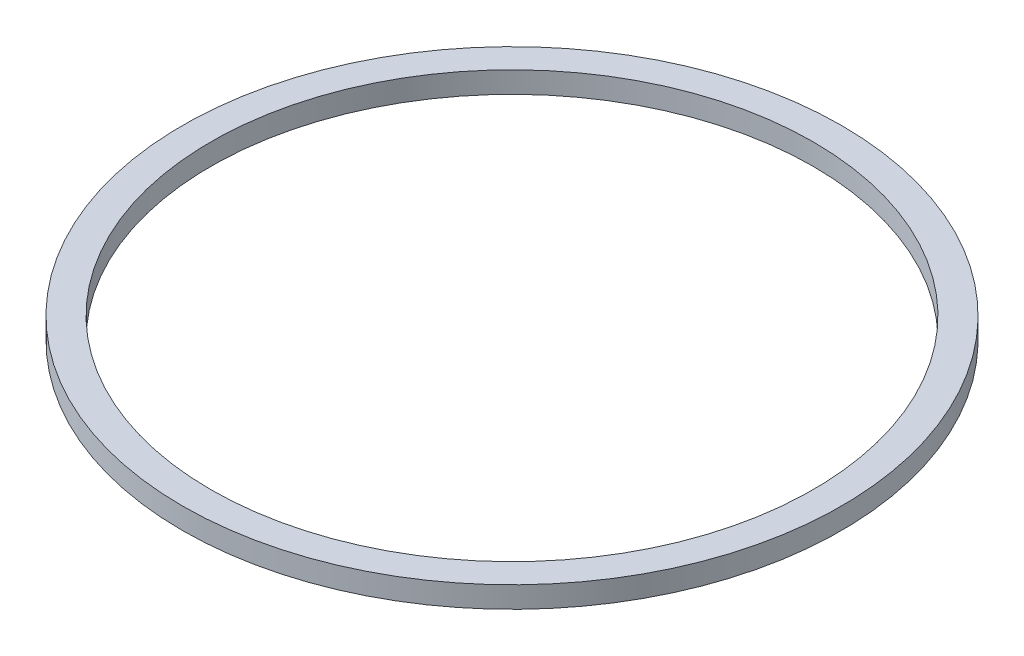
ISO-10303-21;
HEADER;
FILE_DESCRIPTION(('STEP AP214'),'2;1');
FILE_NAME('part.step','',(''),(''),'','','');
FILE_SCHEMA(('AUTOMOTIVE_DESIGN { 1 0 10303 214 1 1 1 1 }'));
ENDSEC;
DATA;
#1=APPLICATION_CONTEXT('core data for automotive mechanical design processes');
#2=APPLICATION_PROTOCOL_DEFINITION('international standard','automotive_design',2000,#1);
#3=PRODUCT_CONTEXT('',#1,'mechanical');
#4=PRODUCT('Part','Part','',(#3));
#5=PRODUCT_RELATED_PRODUCT_CATEGORY('part','',(#4));
#6=PRODUCT_DEFINITION_FORMATION('','',#4);
#7=PRODUCT_DEFINITION_CONTEXT('part definition',#1,'design');
#8=PRODUCT_DEFINITION('design','',#6,#7);
#9=PRODUCT_DEFINITION_SHAPE('','',#8);
#10=(LENGTH_UNIT() NAMED_UNIT(*) SI_UNIT(.MILLI.,.METRE.));
#11=(NAMED_UNIT(*) PLANE_ANGLE_UNIT() SI_UNIT($,.RADIAN.));
#12=(NAMED_UNIT(*) SI_UNIT($,.STERADIAN.) SOLID_ANGLE_UNIT());
#13=UNCERTAINTY_MEASURE_WITH_UNIT(LENGTH_MEASURE(1.E-05),#10,'distance_accuracy_value','');
#14=(GEOMETRIC_REPRESENTATION_CONTEXT(3) GLOBAL_UNCERTAINTY_ASSIGNED_CONTEXT((#13)) GLOBAL_UNIT_ASSIGNED_CONTEXT((#10,
#11,#12)) REPRESENTATION_CONTEXT('',''));
#15=CARTESIAN_POINT('',(0.,0.,0.));
#16=DIRECTION('',(0.,0.,1.));
#17=DIRECTION('',(1.,0.,0.));
#18=AXIS2_PLACEMENT_3D('',#15,#16,#17);
#19=CARTESIAN_POINT('',(0.,3.,0.));
#20=DIRECTION('',(0.,1.,0.));
#21=DIRECTION('',(0.,0.,1.));
#22=AXIS2_PLACEMENT_3D('',#19,#20,#21);
#23=PLANE('',#22);
#24=CARTESIAN_POINT('',(0.,3.,0.));
#25=DIRECTION('',(0.,1.,0.));
#26=DIRECTION('',(0.,0.,1.));
#27=AXIS2_PLACEMENT_3D('',#24,#25,#26);
#28=CIRCLE('',#27,46.5);
#29=CARTESIAN_POINT('',(0.,3.,46.5));
#30=VERTEX_POINT('',#29);
#31=EDGE_CURVE('E10',#30,#30,#28,.T.);
#32=ORIENTED_EDGE('',*,*,#31,.T.);
#33=EDGE_LOOP('',(#32));
#34=FACE_BOUND('',#33,.T.);
#35=CARTESIAN_POINT('',(0.,3.,0.));
#36=DIRECTION('',(0.,1.,0.));
#37=DIRECTION('',(0.,0.,1.));
#38=AXIS2_PLACEMENT_3D('',#35,#36,#37);
#39=CIRCLE('',#38,42.5);
#40=CARTESIAN_POINT('',(0.,3.,42.5));
#41=VERTEX_POINT('',#40);
#42=EDGE_CURVE('E54',#41,#41,#39,.T.);
#43=ORIENTED_EDGE('',*,*,#42,.F.);
#44=EDGE_LOOP('',(#43));
#45=FACE_BOUND('',#44,.T.);
#46=ADVANCED_FACE('F41',(#34,#45),#23,.T.);
#47=CARTESIAN_POINT('',(0.,0.,0.));
#48=DIRECTION('',(0.,1.,0.));
#49=DIRECTION('',(0.,0.,1.));
#50=AXIS2_PLACEMENT_3D('',#47,#48,#49);
#51=PLANE('',#50);
#52=CARTESIAN_POINT('',(0.,0.,0.));
#53=DIRECTION('',(0.,1.,0.));
#54=DIRECTION('',(0.,0.,1.));
#55=AXIS2_PLACEMENT_3D('',#52,#53,#54);
#56=CIRCLE('',#55,46.5);
#57=CARTESIAN_POINT('',(0.,0.,46.5));
#58=VERTEX_POINT('',#57);
#59=EDGE_CURVE('E45',#58,#58,#56,.T.);
#60=ORIENTED_EDGE('',*,*,#59,.F.);
#61=EDGE_LOOP('',(#60));
#62=FACE_BOUND('',#61,.T.);
#63=CARTESIAN_POINT('',(0.,0.,0.));
#64=DIRECTION('',(0.,1.,0.));
#65=DIRECTION('',(0.,0.,1.));
#66=AXIS2_PLACEMENT_3D('',#63,#64,#65);
#67=CIRCLE('',#66,42.5);
#68=CARTESIAN_POINT('',(0.,0.,42.5));
#69=VERTEX_POINT('',#68);
#70=EDGE_CURVE('E56',#69,#69,#67,.T.);
#71=ORIENTED_EDGE('',*,*,#70,.T.);
#72=EDGE_LOOP('',(#71));
#73=FACE_BOUND('',#72,.T.);
#74=ADVANCED_FACE('F68',(#62,#73),#51,.F.);
#75=CARTESIAN_POINT('',(0.,3.,0.));
#76=DIRECTION('',(0.,-1.,0.));
#77=DIRECTION('',(0.,0.,-1.));
#78=AXIS2_PLACEMENT_3D('',#75,#76,#77);
#79=CYLINDRICAL_SURFACE('',#78,46.5);
#80=ORIENTED_EDGE('',*,*,#31,.F.);
#81=EDGE_LOOP('',(#80));
#82=FACE_BOUND('',#81,.T.);
#83=ORIENTED_EDGE('',*,*,#59,.T.);
#84=EDGE_LOOP('',(#83));
#85=FACE_BOUND('',#84,.T.);
#86=ADVANCED_FACE('F43',(#82,#85),#79,.T.);
#87=CARTESIAN_POINT('',(0.,3.,0.));
#88=DIRECTION('',(0.,-1.,0.));
#89=DIRECTION('',(0.,0.,-1.));
#90=AXIS2_PLACEMENT_3D('',#87,#88,#89);
#91=CYLINDRICAL_SURFACE('',#90,42.5);
#92=ORIENTED_EDGE('',*,*,#42,.T.);
#93=EDGE_LOOP('',(#92));
#94=FACE_BOUND('',#93,.T.);
#95=ORIENTED_EDGE('',*,*,#70,.F.);
#96=EDGE_LOOP('',(#95));
#97=FACE_BOUND('',#96,.T.);
#98=ADVANCED_FACE('F64',(#94,#97),#91,.F.);
#99=CLOSED_SHELL('',(#46,#74,#86,#98));
#100=MANIFOLD_SOLID_BREP('B2',#99);
#101=ADVANCED_BREP_SHAPE_REPRESENTATION('',(#18,#100),#14);
#102=SHAPE_DEFINITION_REPRESENTATION(#9,#101);
ENDSEC;
END-ISO-10303-21;
